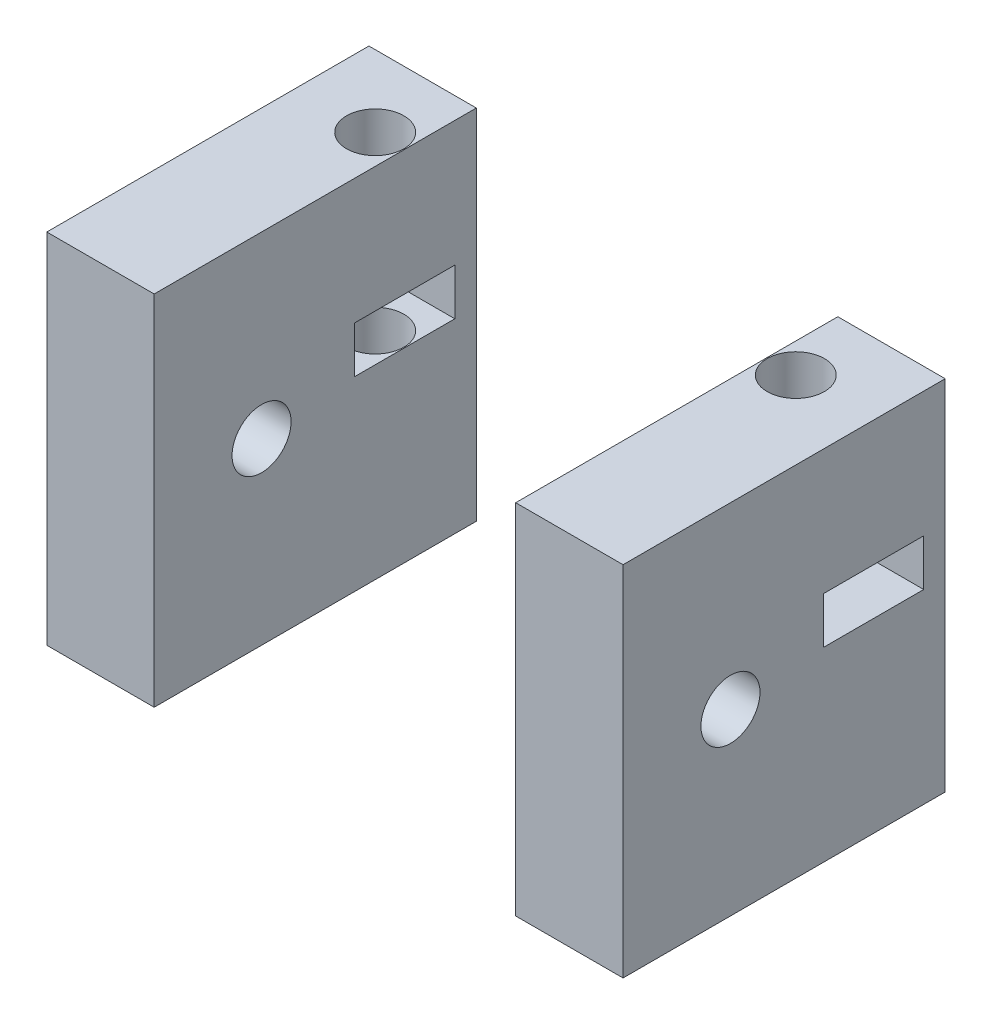
ISO-10303-21;
HEADER;
FILE_DESCRIPTION(('STEP AP214'),'2;1');
FILE_NAME('part.step','',(''),(''),'','','');
FILE_SCHEMA(('AUTOMOTIVE_DESIGN { 1 0 10303 214 1 1 1 1 }'));
ENDSEC;
DATA;
#1=APPLICATION_CONTEXT('core data for automotive mechanical design processes');
#2=APPLICATION_PROTOCOL_DEFINITION('international standard','automotive_design',2000,#1);
#3=PRODUCT_CONTEXT('',#1,'mechanical');
#4=PRODUCT('Part','Part','',(#3));
#5=PRODUCT_RELATED_PRODUCT_CATEGORY('part','',(#4));
#6=PRODUCT_DEFINITION_FORMATION('','',#4);
#7=PRODUCT_DEFINITION_CONTEXT('part definition',#1,'design');
#8=PRODUCT_DEFINITION('design','',#6,#7);
#9=PRODUCT_DEFINITION_SHAPE('','',#8);
#10=(LENGTH_UNIT() NAMED_UNIT(*) SI_UNIT(.MILLI.,.METRE.));
#11=(NAMED_UNIT(*) PLANE_ANGLE_UNIT() SI_UNIT($,.RADIAN.));
#12=(NAMED_UNIT(*) SI_UNIT($,.STERADIAN.) SOLID_ANGLE_UNIT());
#13=UNCERTAINTY_MEASURE_WITH_UNIT(LENGTH_MEASURE(1.E-05),#10,'distance_accuracy_value','');
#14=(GEOMETRIC_REPRESENTATION_CONTEXT(3) GLOBAL_UNCERTAINTY_ASSIGNED_CONTEXT((#13)) GLOBAL_UNIT_ASSIGNED_CONTEXT((#10,
#11,#12)) REPRESENTATION_CONTEXT('',''));
#15=CARTESIAN_POINT('',(0.,0.,0.));
#16=DIRECTION('',(0.,0.,1.));
#17=DIRECTION('',(1.,0.,0.));
#18=AXIS2_PLACEMENT_3D('',#15,#16,#17);
#19=CARTESIAN_POINT('',(11.75,-20.,0.));
#20=DIRECTION('',(0.,1.,0.));
#21=DIRECTION('',(0.,0.,1.));
#22=AXIS2_PLACEMENT_3D('',#19,#20,#21);
#23=CYLINDRICAL_SURFACE('',#22,1.6);
#24=CARTESIAN_POINT('',(11.75,-7.,0.));
#25=DIRECTION('',(0.,1.,0.));
#26=DIRECTION('',(0.,0.,1.));
#27=AXIS2_PLACEMENT_3D('',#24,#25,#26);
#28=CIRCLE('',#27,1.6);
#29=CARTESIAN_POINT('',(11.75,-7.,1.6));
#30=VERTEX_POINT('',#29);
#31=EDGE_CURVE('E156',#30,#30,#28,.F.);
#32=ORIENTED_EDGE('',*,*,#31,.T.);
#33=EDGE_LOOP('',(#32));
#34=FACE_BOUND('',#33,.T.);
#35=CARTESIAN_POINT('',(11.75,0.,0.));
#36=DIRECTION('',(0.,1.,0.));
#37=DIRECTION('',(0.,0.,1.));
#38=AXIS2_PLACEMENT_3D('',#35,#36,#37);
#39=CIRCLE('',#38,1.6);
#40=CARTESIAN_POINT('',(11.75,0.,1.6));
#41=VERTEX_POINT('',#40);
#42=EDGE_CURVE('E166',#41,#41,#39,.T.);
#43=ORIENTED_EDGE('',*,*,#42,.T.);
#44=EDGE_LOOP('',(#43));
#45=FACE_BOUND('',#44,.T.);
#46=ADVANCED_FACE('F49',(#34,#45),#23,.F.);
#47=CARTESIAN_POINT('',(16.1,-20.,-4.));
#48=DIRECTION('',(1.,0.,0.));
#49=DIRECTION('',(0.,0.,-1.));
#50=AXIS2_PLACEMENT_3D('',#47,#48,#49);
#51=PLANE('',#50);
#52=DIRECTION('',(0.,-1.,0.));
#53=VECTOR('',#52,1.);
#54=CARTESIAN_POINT('',(16.1,-7.,2.8));
#55=LINE('',#54,#53);
#56=CARTESIAN_POINT('',(16.1,-7.,2.8));
#57=VERTEX_POINT('',#56);
#58=CARTESIAN_POINT('',(16.1,-9.6,2.8));
#59=VERTEX_POINT('',#58);
#60=EDGE_CURVE('E65',#57,#59,#55,.T.);
#61=ORIENTED_EDGE('',*,*,#60,.F.);
#62=DIRECTION('',(0.,0.,1.));
#63=VECTOR('',#62,1.);
#64=CARTESIAN_POINT('',(16.1,-7.,2.8));
#65=LINE('',#64,#63);
#66=CARTESIAN_POINT('',(16.1,-7.,-2.8));
#67=VERTEX_POINT('',#66);
#68=EDGE_CURVE('E134',#67,#57,#65,.T.);
#69=ORIENTED_EDGE('',*,*,#68,.F.);
#70=DIRECTION('',(0.,1.,0.));
#71=VECTOR('',#70,1.);
#72=CARTESIAN_POINT('',(16.1,-7.,-2.8));
#73=LINE('',#72,#71);
#74=CARTESIAN_POINT('',(16.1,-9.6,-2.8));
#75=VERTEX_POINT('',#74);
#76=EDGE_CURVE('E117',#75,#67,#73,.T.);
#77=ORIENTED_EDGE('',*,*,#76,.F.);
#78=DIRECTION('',(0.,0.,-1.));
#79=VECTOR('',#78,1.);
#80=CARTESIAN_POINT('',(16.1,-9.6,2.8));
#81=LINE('',#80,#79);
#82=EDGE_CURVE('E126',#59,#75,#81,.T.);
#83=ORIENTED_EDGE('',*,*,#82,.F.);
#84=EDGE_LOOP('',(#61,#69,#77,#83));
#85=FACE_BOUND('',#84,.T.);
#86=CARTESIAN_POINT('',(16.1,-10.,8.));
#87=DIRECTION('',(1.,0.,0.));
#88=DIRECTION('',(0.,0.,-1.));
#89=AXIS2_PLACEMENT_3D('',#86,#87,#88);
#90=CIRCLE('',#89,1.65);
#91=CARTESIAN_POINT('',(16.1,-10.,6.35));
#92=VERTEX_POINT('',#91);
#93=EDGE_CURVE('E149',#92,#92,#90,.T.);
#94=ORIENTED_EDGE('',*,*,#93,.F.);
#95=EDGE_LOOP('',(#94));
#96=FACE_BOUND('',#95,.T.);
#97=DIRECTION('',(0.,0.,-1.));
#98=VECTOR('',#97,1.);
#99=CARTESIAN_POINT('',(16.1,0.,-4.));
#100=LINE('',#99,#98);
#101=CARTESIAN_POINT('',(16.1,0.,14.));
#102=VERTEX_POINT('',#101);
#103=CARTESIAN_POINT('',(16.1,0.,-4.));
#104=VERTEX_POINT('',#103);
#105=EDGE_CURVE('E165',#102,#104,#100,.T.);
#106=ORIENTED_EDGE('',*,*,#105,.F.);
#107=DIRECTION('',(0.,1.,0.));
#108=VECTOR('',#107,1.);
#109=CARTESIAN_POINT('',(16.1,-20.,14.));
#110=LINE('',#109,#108);
#111=CARTESIAN_POINT('',(16.1,-20.,14.));
#112=VERTEX_POINT('',#111);
#113=EDGE_CURVE('E202',#112,#102,#110,.T.);
#114=ORIENTED_EDGE('',*,*,#113,.F.);
#115=DIRECTION('',(0.,0.,-1.));
#116=VECTOR('',#115,1.);
#117=CARTESIAN_POINT('',(16.1,-20.,-4.));
#118=LINE('',#117,#116);
#119=CARTESIAN_POINT('',(16.1,-20.,-4.));
#120=VERTEX_POINT('',#119);
#121=EDGE_CURVE('E170',#112,#120,#118,.T.);
#122=ORIENTED_EDGE('',*,*,#121,.T.);
#123=DIRECTION('',(0.,1.,0.));
#124=VECTOR('',#123,1.);
#125=CARTESIAN_POINT('',(16.1,-20.,-4.));
#126=LINE('',#125,#124);
#127=EDGE_CURVE('E187',#120,#104,#126,.T.);
#128=ORIENTED_EDGE('',*,*,#127,.T.);
#129=EDGE_LOOP('',(#106,#114,#122,#128));
#130=FACE_BOUND('',#129,.T.);
#131=ADVANCED_FACE('F51',(#85,#96,#130),#51,.T.);
#132=CARTESIAN_POINT('',(16.1,-20.,14.));
#133=DIRECTION('',(0.,0.,1.));
#134=DIRECTION('',(1.,0.,0.));
#135=AXIS2_PLACEMENT_3D('',#132,#133,#134);
#136=PLANE('',#135);
#137=DIRECTION('',(1.,0.,0.));
#138=VECTOR('',#137,1.);
#139=CARTESIAN_POINT('',(16.1,0.,14.));
#140=LINE('',#139,#138);
#141=CARTESIAN_POINT('',(10.1,0.,14.));
#142=VERTEX_POINT('',#141);
#143=EDGE_CURVE('E175',#142,#102,#140,.T.);
#144=ORIENTED_EDGE('',*,*,#143,.F.);
#145=DIRECTION('',(0.,1.,0.));
#146=VECTOR('',#145,1.);
#147=CARTESIAN_POINT('',(10.1,-20.,14.));
#148=LINE('',#147,#146);
#149=CARTESIAN_POINT('',(10.1,-20.,14.));
#150=VERTEX_POINT('',#149);
#151=EDGE_CURVE('E205',#150,#142,#148,.T.);
#152=ORIENTED_EDGE('',*,*,#151,.F.);
#153=DIRECTION('',(1.,0.,0.));
#154=VECTOR('',#153,1.);
#155=CARTESIAN_POINT('',(16.1,-20.,14.));
#156=LINE('',#155,#154);
#157=EDGE_CURVE('E183',#150,#112,#156,.T.);
#158=ORIENTED_EDGE('',*,*,#157,.T.);
#159=ORIENTED_EDGE('',*,*,#113,.T.);
#160=EDGE_LOOP('',(#144,#152,#158,#159));
#161=FACE_BOUND('',#160,.T.);
#162=ADVANCED_FACE('F231',(#161),#136,.T.);
#163=CARTESIAN_POINT('',(10.1,-20.,14.));
#164=DIRECTION('',(-1.,0.,0.));
#165=DIRECTION('',(0.,0.,1.));
#166=AXIS2_PLACEMENT_3D('',#163,#164,#165);
#167=PLANE('',#166);
#168=DIRECTION('',(0.,1.,0.));
#169=VECTOR('',#168,1.);
#170=CARTESIAN_POINT('',(10.1,-20.,2.8));
#171=LINE('',#170,#169);
#172=CARTESIAN_POINT('',(10.1,-9.6,2.8));
#173=VERTEX_POINT('',#172);
#174=CARTESIAN_POINT('',(10.1,-7.,2.8));
#175=VERTEX_POINT('',#174);
#176=EDGE_CURVE('E12',#173,#175,#171,.T.);
#177=ORIENTED_EDGE('',*,*,#176,.F.);
#178=DIRECTION('',(0.,0.,1.));
#179=VECTOR('',#178,1.);
#180=CARTESIAN_POINT('',(10.1,-9.6,14.));
#181=LINE('',#180,#179);
#182=CARTESIAN_POINT('',(10.1,-9.6,-2.8));
#183=VERTEX_POINT('',#182);
#184=EDGE_CURVE('E153',#183,#173,#181,.T.);
#185=ORIENTED_EDGE('',*,*,#184,.F.);
#186=DIRECTION('',(0.,-1.,0.));
#187=VECTOR('',#186,1.);
#188=CARTESIAN_POINT('',(10.1,-20.,-2.8));
#189=LINE('',#188,#187);
#190=CARTESIAN_POINT('',(10.1,-7.,-2.8));
#191=VERTEX_POINT('',#190);
#192=EDGE_CURVE('E58',#191,#183,#189,.T.);
#193=ORIENTED_EDGE('',*,*,#192,.F.);
#194=DIRECTION('',(0.,0.,-1.));
#195=VECTOR('',#194,1.);
#196=CARTESIAN_POINT('',(10.1,-7.,14.));
#197=LINE('',#196,#195);
#198=EDGE_CURVE('E157',#175,#191,#197,.T.);
#199=ORIENTED_EDGE('',*,*,#198,.F.);
#200=EDGE_LOOP('',(#177,#185,#193,#199));
#201=FACE_BOUND('',#200,.T.);
#202=CARTESIAN_POINT('',(10.1,-10.,8.));
#203=DIRECTION('',(-1.,0.,0.));
#204=DIRECTION('',(0.,0.,1.));
#205=AXIS2_PLACEMENT_3D('',#202,#203,#204);
#206=CIRCLE('',#205,1.65);
#207=CARTESIAN_POINT('',(10.1,-10.,9.65));
#208=VERTEX_POINT('',#207);
#209=EDGE_CURVE('E160',#208,#208,#206,.T.);
#210=ORIENTED_EDGE('',*,*,#209,.F.);
#211=EDGE_LOOP('',(#210));
#212=FACE_BOUND('',#211,.T.);
#213=DIRECTION('',(0.,0.,1.));
#214=VECTOR('',#213,1.);
#215=CARTESIAN_POINT('',(10.1,0.,14.));
#216=LINE('',#215,#214);
#217=CARTESIAN_POINT('',(10.1,0.,-4.));
#218=VERTEX_POINT('',#217);
#219=EDGE_CURVE('E195',#218,#142,#216,.T.);
#220=ORIENTED_EDGE('',*,*,#219,.F.);
#221=DIRECTION('',(0.,1.,0.));
#222=VECTOR('',#221,1.);
#223=CARTESIAN_POINT('',(10.1,-20.,-4.));
#224=LINE('',#223,#222);
#225=CARTESIAN_POINT('',(10.1,-20.,-4.));
#226=VERTEX_POINT('',#225);
#227=EDGE_CURVE('E208',#226,#218,#224,.T.);
#228=ORIENTED_EDGE('',*,*,#227,.F.);
#229=DIRECTION('',(0.,0.,1.));
#230=VECTOR('',#229,1.);
#231=CARTESIAN_POINT('',(10.1,-20.,14.));
#232=LINE('',#231,#230);
#233=EDGE_CURVE('E179',#226,#150,#232,.T.);
#234=ORIENTED_EDGE('',*,*,#233,.T.);
#235=ORIENTED_EDGE('',*,*,#151,.T.);
#236=EDGE_LOOP('',(#220,#228,#234,#235));
#237=FACE_BOUND('',#236,.T.);
#238=ADVANCED_FACE('F227',(#201,#212,#237),#167,.T.);
#239=CARTESIAN_POINT('',(10.1,-20.,-4.));
#240=DIRECTION('',(0.,0.,-1.));
#241=DIRECTION('',(-1.,0.,0.));
#242=AXIS2_PLACEMENT_3D('',#239,#240,#241);
#243=PLANE('',#242);
#244=DIRECTION('',(-1.,0.,0.));
#245=VECTOR('',#244,1.);
#246=CARTESIAN_POINT('',(10.1,0.,-4.));
#247=LINE('',#246,#245);
#248=EDGE_CURVE('E191',#104,#218,#247,.T.);
#249=ORIENTED_EDGE('',*,*,#248,.F.);
#250=ORIENTED_EDGE('',*,*,#127,.F.);
#251=DIRECTION('',(-1.,0.,0.));
#252=VECTOR('',#251,1.);
#253=CARTESIAN_POINT('',(10.1,-20.,-4.));
#254=LINE('',#253,#252);
#255=EDGE_CURVE('E174',#120,#226,#254,.T.);
#256=ORIENTED_EDGE('',*,*,#255,.T.);
#257=ORIENTED_EDGE('',*,*,#227,.T.);
#258=EDGE_LOOP('',(#249,#250,#256,#257));
#259=FACE_BOUND('',#258,.T.);
#260=ADVANCED_FACE('F230',(#259),#243,.T.);
#261=CARTESIAN_POINT('',(0.,-20.,0.));
#262=DIRECTION('',(0.,-1.,0.));
#263=DIRECTION('',(0.,0.,-1.));
#264=AXIS2_PLACEMENT_3D('',#261,#262,#263);
#265=PLANE('',#264);
#266=CARTESIAN_POINT('',(11.75,-20.,0.));
#267=DIRECTION('',(0.,1.,0.));
#268=DIRECTION('',(0.,0.,1.));
#269=AXIS2_PLACEMENT_3D('',#266,#267,#268);
#270=CIRCLE('',#269,1.6);
#271=CARTESIAN_POINT('',(11.75,-20.,1.6));
#272=VERTEX_POINT('',#271);
#273=EDGE_CURVE('E161',#272,#272,#270,.T.);
#274=ORIENTED_EDGE('',*,*,#273,.T.);
#275=EDGE_LOOP('',(#274));
#276=FACE_BOUND('',#275,.T.);
#277=ORIENTED_EDGE('',*,*,#121,.F.);
#278=ORIENTED_EDGE('',*,*,#157,.F.);
#279=ORIENTED_EDGE('',*,*,#233,.F.);
#280=ORIENTED_EDGE('',*,*,#255,.F.);
#281=EDGE_LOOP('',(#277,#278,#279,#280));
#282=FACE_BOUND('',#281,.T.);
#283=ADVANCED_FACE('F245',(#276,#282),#265,.T.);
#284=CARTESIAN_POINT('',(0.,0.,0.));
#285=DIRECTION('',(0.,-1.,0.));
#286=DIRECTION('',(0.,0.,-1.));
#287=AXIS2_PLACEMENT_3D('',#284,#285,#286);
#288=PLANE('',#287);
#289=ORIENTED_EDGE('',*,*,#42,.F.);
#290=EDGE_LOOP('',(#289));
#291=FACE_BOUND('',#290,.T.);
#292=ORIENTED_EDGE('',*,*,#105,.T.);
#293=ORIENTED_EDGE('',*,*,#248,.T.);
#294=ORIENTED_EDGE('',*,*,#219,.T.);
#295=ORIENTED_EDGE('',*,*,#143,.T.);
#296=EDGE_LOOP('',(#292,#293,#294,#295));
#297=FACE_BOUND('',#296,.T.);
#298=ADVANCED_FACE('F239',(#291,#297),#288,.F.);
#299=CARTESIAN_POINT('',(11.75,-9.6,0.));
#300=DIRECTION('',(0.,-1.,0.));
#301=DIRECTION('',(0.,0.,-1.));
#302=AXIS2_PLACEMENT_3D('',#299,#300,#301);
#303=CIRCLE('',#302,1.6);
#304=CARTESIAN_POINT('',(11.75,-9.6,-1.60000000000001));
#305=VERTEX_POINT('',#304);
#306=EDGE_CURVE('E144',#305,#305,#303,.F.);
#307=ORIENTED_EDGE('',*,*,#306,.T.);
#308=EDGE_LOOP('',(#307));
#309=FACE_BOUND('',#308,.T.);
#310=ORIENTED_EDGE('',*,*,#273,.F.);
#311=EDGE_LOOP('',(#310));
#312=FACE_BOUND('',#311,.T.);
#313=ADVANCED_FACE('F258',(#309,#312),#23,.F.);
#314=CARTESIAN_POINT('',(-16.1,-7.,2.8));
#315=DIRECTION('',(0.,1.,0.));
#316=DIRECTION('',(0.,0.,1.));
#317=AXIS2_PLACEMENT_3D('',#314,#315,#316);
#318=PLANE('',#317);
#319=ORIENTED_EDGE('',*,*,#198,.T.);
#320=DIRECTION('',(1.,0.,0.));
#321=VECTOR('',#320,1.);
#322=CARTESIAN_POINT('',(-16.1,-7.,-2.8));
#323=LINE('',#322,#321);
#324=EDGE_CURVE('E122',#191,#67,#323,.T.);
#325=ORIENTED_EDGE('',*,*,#324,.T.);
#326=ORIENTED_EDGE('',*,*,#68,.T.);
#327=DIRECTION('',(1.,0.,0.));
#328=VECTOR('',#327,1.);
#329=CARTESIAN_POINT('',(-16.1,-7.,2.8));
#330=LINE('',#329,#328);
#331=EDGE_CURVE('E141',#175,#57,#330,.T.);
#332=ORIENTED_EDGE('',*,*,#331,.F.);
#333=EDGE_LOOP('',(#319,#325,#326,#332));
#334=FACE_BOUND('',#333,.T.);
#335=ORIENTED_EDGE('',*,*,#31,.F.);
#336=EDGE_LOOP('',(#335));
#337=FACE_BOUND('',#336,.T.);
#338=ADVANCED_FACE('F265',(#334,#337),#318,.F.);
#339=CARTESIAN_POINT('',(-16.1,-9.6,2.8));
#340=DIRECTION('',(0.,-1.,0.));
#341=DIRECTION('',(0.,0.,-1.));
#342=AXIS2_PLACEMENT_3D('',#339,#340,#341);
#343=PLANE('',#342);
#344=ORIENTED_EDGE('',*,*,#184,.T.);
#345=DIRECTION('',(1.,0.,0.));
#346=VECTOR('',#345,1.);
#347=CARTESIAN_POINT('',(-16.1,-9.6,2.8));
#348=LINE('',#347,#346);
#349=EDGE_CURVE('E123',#173,#59,#348,.T.);
#350=ORIENTED_EDGE('',*,*,#349,.T.);
#351=ORIENTED_EDGE('',*,*,#82,.T.);
#352=DIRECTION('',(1.,0.,0.));
#353=VECTOR('',#352,1.);
#354=CARTESIAN_POINT('',(-16.1,-9.6,-2.8));
#355=LINE('',#354,#353);
#356=EDGE_CURVE('E73',#183,#75,#355,.T.);
#357=ORIENTED_EDGE('',*,*,#356,.F.);
#358=EDGE_LOOP('',(#344,#350,#351,#357));
#359=FACE_BOUND('',#358,.T.);
#360=ORIENTED_EDGE('',*,*,#306,.F.);
#361=EDGE_LOOP('',(#360));
#362=FACE_BOUND('',#361,.T.);
#363=ADVANCED_FACE('F127',(#359,#362),#343,.F.);
#364=CARTESIAN_POINT('',(-16.1,-7.,2.8));
#365=DIRECTION('',(0.,0.,1.));
#366=DIRECTION('',(1.,0.,0.));
#367=AXIS2_PLACEMENT_3D('',#364,#365,#366);
#368=PLANE('',#367);
#369=ORIENTED_EDGE('',*,*,#176,.T.);
#370=ORIENTED_EDGE('',*,*,#331,.T.);
#371=ORIENTED_EDGE('',*,*,#60,.T.);
#372=ORIENTED_EDGE('',*,*,#349,.F.);
#373=EDGE_LOOP('',(#369,#370,#371,#372));
#374=FACE_BOUND('',#373,.T.);
#375=ADVANCED_FACE('F313',(#374),#368,.F.);
#376=CARTESIAN_POINT('',(-16.1,-7.,-2.8));
#377=DIRECTION('',(0.,0.,-1.));
#378=DIRECTION('',(0.,1.,0.));
#379=AXIS2_PLACEMENT_3D('',#376,#377,#378);
#380=PLANE('',#379);
#381=ORIENTED_EDGE('',*,*,#192,.T.);
#382=ORIENTED_EDGE('',*,*,#356,.T.);
#383=ORIENTED_EDGE('',*,*,#76,.T.);
#384=ORIENTED_EDGE('',*,*,#324,.F.);
#385=EDGE_LOOP('',(#381,#382,#383,#384));
#386=FACE_BOUND('',#385,.T.);
#387=ADVANCED_FACE('F114',(#386),#380,.F.);
#388=CARTESIAN_POINT('',(-16.1,-10.,8.));
#389=DIRECTION('',(1.,0.,0.));
#390=DIRECTION('',(0.,0.,-1.));
#391=AXIS2_PLACEMENT_3D('',#388,#389,#390);
#392=CYLINDRICAL_SURFACE('',#391,1.65);
#393=ORIENTED_EDGE('',*,*,#209,.T.);
#394=EDGE_LOOP('',(#393));
#395=FACE_BOUND('',#394,.T.);
#396=ORIENTED_EDGE('',*,*,#93,.T.);
#397=EDGE_LOOP('',(#396));
#398=FACE_BOUND('',#397,.T.);
#399=ADVANCED_FACE('F224',(#395,#398),#392,.F.);
#400=CLOSED_SHELL('',(#46,#131,#162,#238,#260,#283,#298,#313,#338,#363,#375,#387,#399));
#401=MANIFOLD_SOLID_BREP('B2',#400);
#402=CARTESIAN_POINT('',(-11.75,-20.,0.));
#403=DIRECTION('',(0.,1.,0.));
#404=DIRECTION('',(0.,0.,1.));
#405=AXIS2_PLACEMENT_3D('',#402,#403,#404);
#406=CYLINDRICAL_SURFACE('',#405,1.6);
#407=CARTESIAN_POINT('',(-11.75,-7.,0.));
#408=DIRECTION('',(0.,1.,0.));
#409=DIRECTION('',(0.,0.,1.));
#410=AXIS2_PLACEMENT_3D('',#407,#408,#409);
#411=CIRCLE('',#410,1.6);
#412=CARTESIAN_POINT('',(-11.75,-7.,1.6));
#413=VERTEX_POINT('',#412);
#414=EDGE_CURVE('E375',#413,#413,#411,.F.);
#415=ORIENTED_EDGE('',*,*,#414,.T.);
#416=EDGE_LOOP('',(#415));
#417=FACE_BOUND('',#416,.T.);
#418=CARTESIAN_POINT('',(-11.75,0.,0.));
#419=DIRECTION('',(0.,1.,0.));
#420=DIRECTION('',(0.,0.,1.));
#421=AXIS2_PLACEMENT_3D('',#418,#419,#420);
#422=CIRCLE('',#421,1.6);
#423=CARTESIAN_POINT('',(-11.75,0.,1.6));
#424=VERTEX_POINT('',#423);
#425=EDGE_CURVE('E481',#424,#424,#422,.T.);
#426=ORIENTED_EDGE('',*,*,#425,.T.);
#427=EDGE_LOOP('',(#426));
#428=FACE_BOUND('',#427,.T.);
#429=ADVANCED_FACE('F371',(#417,#428),#406,.F.);
#430=CARTESIAN_POINT('',(-10.1,-20.,14.));
#431=DIRECTION('',(1.,0.,0.));
#432=DIRECTION('',(0.,0.,-1.));
#433=AXIS2_PLACEMENT_3D('',#430,#431,#432);
#434=PLANE('',#433);
#435=DIRECTION('',(0.,-1.,0.));
#436=VECTOR('',#435,1.);
#437=CARTESIAN_POINT('',(-10.1,-20.,2.8));
#438=LINE('',#437,#436);
#439=CARTESIAN_POINT('',(-10.1,-7.,2.8));
#440=VERTEX_POINT('',#439);
#441=CARTESIAN_POINT('',(-10.1,-9.6,2.8));
#442=VERTEX_POINT('',#441);
#443=EDGE_CURVE('E443',#440,#442,#438,.T.);
#444=ORIENTED_EDGE('',*,*,#443,.F.);
#445=DIRECTION('',(0.,0.,1.));
#446=VECTOR('',#445,1.);
#447=CARTESIAN_POINT('',(-10.1,-7.,14.));
#448=LINE('',#447,#446);
#449=CARTESIAN_POINT('',(-10.1,-7.,-2.8));
#450=VERTEX_POINT('',#449);
#451=EDGE_CURVE('E473',#450,#440,#448,.T.);
#452=ORIENTED_EDGE('',*,*,#451,.F.);
#453=DIRECTION('',(0.,1.,0.));
#454=VECTOR('',#453,1.);
#455=CARTESIAN_POINT('',(-10.1,-20.,-2.8));
#456=LINE('',#455,#454);
#457=CARTESIAN_POINT('',(-10.1,-9.6,-2.8));
#458=VERTEX_POINT('',#457);
#459=EDGE_CURVE('E478',#458,#450,#456,.T.);
#460=ORIENTED_EDGE('',*,*,#459,.F.);
#461=DIRECTION('',(0.,0.,-1.));
#462=VECTOR('',#461,1.);
#463=CARTESIAN_POINT('',(-10.1,-9.6,14.));
#464=LINE('',#463,#462);
#465=EDGE_CURVE('E471',#442,#458,#464,.T.);
#466=ORIENTED_EDGE('',*,*,#465,.F.);
#467=EDGE_LOOP('',(#444,#452,#460,#466));
#468=FACE_BOUND('',#467,.T.);
#469=CARTESIAN_POINT('',(-10.1,-10.,8.));
#470=DIRECTION('',(1.,0.,0.));
#471=DIRECTION('',(0.,0.,-1.));
#472=AXIS2_PLACEMENT_3D('',#469,#470,#471);
#473=CIRCLE('',#472,1.65);
#474=CARTESIAN_POINT('',(-10.1,-10.,6.35));
#475=VERTEX_POINT('',#474);
#476=EDGE_CURVE('E475',#475,#475,#473,.T.);
#477=ORIENTED_EDGE('',*,*,#476,.F.);
#478=EDGE_LOOP('',(#477));
#479=FACE_BOUND('',#478,.T.);
#480=DIRECTION('',(0.,0.,-1.));
#481=VECTOR('',#480,1.);
#482=CARTESIAN_POINT('',(-10.1,0.,14.));
#483=LINE('',#482,#481);
#484=CARTESIAN_POINT('',(-10.1,0.,14.));
#485=VERTEX_POINT('',#484);
#486=CARTESIAN_POINT('',(-10.1,0.,-4.));
#487=VERTEX_POINT('',#486);
#488=EDGE_CURVE('E485',#485,#487,#483,.T.);
#489=ORIENTED_EDGE('',*,*,#488,.F.);
#490=DIRECTION('',(0.,1.,0.));
#491=VECTOR('',#490,1.);
#492=CARTESIAN_POINT('',(-10.1,-20.,14.));
#493=LINE('',#492,#491);
#494=CARTESIAN_POINT('',(-10.1,-20.,14.));
#495=VERTEX_POINT('',#494);
#496=EDGE_CURVE('E47',#495,#485,#493,.T.);
#497=ORIENTED_EDGE('',*,*,#496,.F.);
#498=DIRECTION('',(0.,0.,-1.));
#499=VECTOR('',#498,1.);
#500=CARTESIAN_POINT('',(-10.1,-20.,14.));
#501=LINE('',#500,#499);
#502=CARTESIAN_POINT('',(-10.1,-20.,-4.));
#503=VERTEX_POINT('',#502);
#504=EDGE_CURVE('E488',#495,#503,#501,.T.);
#505=ORIENTED_EDGE('',*,*,#504,.T.);
#506=DIRECTION('',(0.,1.,0.));
#507=VECTOR('',#506,1.);
#508=CARTESIAN_POINT('',(-10.1,-20.,-4.));
#509=LINE('',#508,#507);
#510=EDGE_CURVE('E501',#503,#487,#509,.T.);
#511=ORIENTED_EDGE('',*,*,#510,.T.);
#512=EDGE_LOOP('',(#489,#497,#505,#511));
#513=FACE_BOUND('',#512,.T.);
#514=ADVANCED_FACE('F373',(#468,#479,#513),#434,.T.);
#515=CARTESIAN_POINT('',(-16.1,-20.,14.));
#516=DIRECTION('',(0.,0.,1.));
#517=DIRECTION('',(1.,0.,0.));
#518=AXIS2_PLACEMENT_3D('',#515,#516,#517);
#519=PLANE('',#518);
#520=DIRECTION('',(1.,0.,0.));
#521=VECTOR('',#520,1.);
#522=CARTESIAN_POINT('',(-16.1,0.,14.));
#523=LINE('',#522,#521);
#524=CARTESIAN_POINT('',(-16.1,0.,14.));
#525=VERTEX_POINT('',#524);
#526=EDGE_CURVE('E492',#525,#485,#523,.T.);
#527=ORIENTED_EDGE('',*,*,#526,.F.);
#528=DIRECTION('',(0.,1.,0.));
#529=VECTOR('',#528,1.);
#530=CARTESIAN_POINT('',(-16.1,-20.,14.));
#531=LINE('',#530,#529);
#532=CARTESIAN_POINT('',(-16.1,-20.,14.));
#533=VERTEX_POINT('',#532);
#534=EDGE_CURVE('E380',#533,#525,#531,.T.);
#535=ORIENTED_EDGE('',*,*,#534,.F.);
#536=DIRECTION('',(1.,0.,0.));
#537=VECTOR('',#536,1.);
#538=CARTESIAN_POINT('',(-16.1,-20.,14.));
#539=LINE('',#538,#537);
#540=EDGE_CURVE('E498',#533,#495,#539,.T.);
#541=ORIENTED_EDGE('',*,*,#540,.T.);
#542=ORIENTED_EDGE('',*,*,#496,.T.);
#543=EDGE_LOOP('',(#527,#535,#541,#542));
#544=FACE_BOUND('',#543,.T.);
#545=ADVANCED_FACE('F538',(#544),#519,.T.);
#546=CARTESIAN_POINT('',(-16.1,-20.,-4.));
#547=DIRECTION('',(-1.,0.,0.));
#548=DIRECTION('',(0.,0.,1.));
#549=AXIS2_PLACEMENT_3D('',#546,#547,#548);
#550=PLANE('',#549);
#551=DIRECTION('',(0.,-1.,0.));
#552=VECTOR('',#551,1.);
#553=CARTESIAN_POINT('',(-16.1,-7.,2.8));
#554=LINE('',#553,#552);
#555=CARTESIAN_POINT('',(-16.1,-7.,2.8));
#556=VERTEX_POINT('',#555);
#557=CARTESIAN_POINT('',(-16.1,-9.6,2.8));
#558=VERTEX_POINT('',#557);
#559=EDGE_CURVE('E440',#556,#558,#554,.T.);
#560=ORIENTED_EDGE('',*,*,#559,.T.);
#561=DIRECTION('',(0.,0.,-1.));
#562=VECTOR('',#561,1.);
#563=CARTESIAN_POINT('',(-16.1,-9.6,2.8));
#564=LINE('',#563,#562);
#565=CARTESIAN_POINT('',(-16.1,-9.6,-2.8));
#566=VERTEX_POINT('',#565);
#567=EDGE_CURVE('E449',#558,#566,#564,.T.);
#568=ORIENTED_EDGE('',*,*,#567,.T.);
#569=DIRECTION('',(0.,1.,0.));
#570=VECTOR('',#569,1.);
#571=CARTESIAN_POINT('',(-16.1,-7.,-2.8));
#572=LINE('',#571,#570);
#573=CARTESIAN_POINT('',(-16.1,-7.,-2.8));
#574=VERTEX_POINT('',#573);
#575=EDGE_CURVE('E396',#566,#574,#572,.T.);
#576=ORIENTED_EDGE('',*,*,#575,.T.);
#577=DIRECTION('',(0.,0.,1.));
#578=VECTOR('',#577,1.);
#579=CARTESIAN_POINT('',(-16.1,-7.,2.8));
#580=LINE('',#579,#578);
#581=EDGE_CURVE('E446',#574,#556,#580,.T.);
#582=ORIENTED_EDGE('',*,*,#581,.T.);
#583=EDGE_LOOP('',(#560,#568,#576,#582));
#584=FACE_BOUND('',#583,.T.);
#585=CARTESIAN_POINT('',(-16.1,-10.,8.));
#586=DIRECTION('',(1.,0.,0.));
#587=DIRECTION('',(0.,0.,-1.));
#588=AXIS2_PLACEMENT_3D('',#585,#586,#587);
#589=CIRCLE('',#588,1.65);
#590=CARTESIAN_POINT('',(-16.1,-10.,6.35));
#591=VERTEX_POINT('',#590);
#592=EDGE_CURVE('E457',#591,#591,#589,.T.);
#593=ORIENTED_EDGE('',*,*,#592,.T.);
#594=EDGE_LOOP('',(#593));
#595=FACE_BOUND('',#594,.T.);
#596=DIRECTION('',(0.,0.,1.));
#597=VECTOR('',#596,1.);
#598=CARTESIAN_POINT('',(-16.1,0.,-4.));
#599=LINE('',#598,#597);
#600=CARTESIAN_POINT('',(-16.1,0.,-4.));
#601=VERTEX_POINT('',#600);
#602=EDGE_CURVE('E507',#601,#525,#599,.T.);
#603=ORIENTED_EDGE('',*,*,#602,.F.);
#604=DIRECTION('',(0.,1.,0.));
#605=VECTOR('',#604,1.);
#606=CARTESIAN_POINT('',(-16.1,-20.,-4.));
#607=LINE('',#606,#605);
#608=CARTESIAN_POINT('',(-16.1,-20.,-4.));
#609=VERTEX_POINT('',#608);
#610=EDGE_CURVE('E513',#609,#601,#607,.T.);
#611=ORIENTED_EDGE('',*,*,#610,.F.);
#612=DIRECTION('',(0.,0.,1.));
#613=VECTOR('',#612,1.);
#614=CARTESIAN_POINT('',(-16.1,-20.,-4.));
#615=LINE('',#614,#613);
#616=EDGE_CURVE('E495',#609,#533,#615,.T.);
#617=ORIENTED_EDGE('',*,*,#616,.T.);
#618=ORIENTED_EDGE('',*,*,#534,.T.);
#619=EDGE_LOOP('',(#603,#611,#617,#618));
#620=FACE_BOUND('',#619,.T.);
#621=ADVANCED_FACE('F454',(#584,#595,#620),#550,.T.);
#622=CARTESIAN_POINT('',(-10.1,-20.,-4.));
#623=DIRECTION('',(0.,0.,-1.));
#624=DIRECTION('',(-1.,0.,0.));
#625=AXIS2_PLACEMENT_3D('',#622,#623,#624);
#626=PLANE('',#625);
#627=DIRECTION('',(-1.,0.,0.));
#628=VECTOR('',#627,1.);
#629=CARTESIAN_POINT('',(-10.1,0.,-4.));
#630=LINE('',#629,#628);
#631=EDGE_CURVE('E504',#487,#601,#630,.T.);
#632=ORIENTED_EDGE('',*,*,#631,.F.);
#633=ORIENTED_EDGE('',*,*,#510,.F.);
#634=DIRECTION('',(-1.,0.,0.));
#635=VECTOR('',#634,1.);
#636=CARTESIAN_POINT('',(-10.1,-20.,-4.));
#637=LINE('',#636,#635);
#638=EDGE_CURVE('E491',#503,#609,#637,.T.);
#639=ORIENTED_EDGE('',*,*,#638,.T.);
#640=ORIENTED_EDGE('',*,*,#610,.T.);
#641=EDGE_LOOP('',(#632,#633,#639,#640));
#642=FACE_BOUND('',#641,.T.);
#643=ADVANCED_FACE('F555',(#642),#626,.T.);
#644=CARTESIAN_POINT('',(0.,-20.,0.));
#645=DIRECTION('',(0.,1.,0.));
#646=DIRECTION('',(0.,0.,1.));
#647=AXIS2_PLACEMENT_3D('',#644,#645,#646);
#648=PLANE('',#647);
#649=CARTESIAN_POINT('',(-11.75,-20.,0.));
#650=DIRECTION('',(0.,1.,0.));
#651=DIRECTION('',(0.,0.,1.));
#652=AXIS2_PLACEMENT_3D('',#649,#650,#651);
#653=CIRCLE('',#652,1.6);
#654=CARTESIAN_POINT('',(-11.75,-20.,1.6));
#655=VERTEX_POINT('',#654);
#656=EDGE_CURVE('E482',#655,#655,#653,.T.);
#657=ORIENTED_EDGE('',*,*,#656,.T.);
#658=EDGE_LOOP('',(#657));
#659=FACE_BOUND('',#658,.T.);
#660=ORIENTED_EDGE('',*,*,#504,.F.);
#661=ORIENTED_EDGE('',*,*,#540,.F.);
#662=ORIENTED_EDGE('',*,*,#616,.F.);
#663=ORIENTED_EDGE('',*,*,#638,.F.);
#664=EDGE_LOOP('',(#660,#661,#662,#663));
#665=FACE_BOUND('',#664,.T.);
#666=ADVANCED_FACE('F549',(#659,#665),#648,.F.);
#667=CARTESIAN_POINT('',(0.,0.,0.));
#668=DIRECTION('',(0.,1.,0.));
#669=DIRECTION('',(0.,0.,1.));
#670=AXIS2_PLACEMENT_3D('',#667,#668,#669);
#671=PLANE('',#670);
#672=ORIENTED_EDGE('',*,*,#425,.F.);
#673=EDGE_LOOP('',(#672));
#674=FACE_BOUND('',#673,.T.);
#675=ORIENTED_EDGE('',*,*,#488,.T.);
#676=ORIENTED_EDGE('',*,*,#631,.T.);
#677=ORIENTED_EDGE('',*,*,#602,.T.);
#678=ORIENTED_EDGE('',*,*,#526,.T.);
#679=EDGE_LOOP('',(#675,#676,#677,#678));
#680=FACE_BOUND('',#679,.T.);
#681=ADVANCED_FACE('F545',(#674,#680),#671,.T.);
#682=CARTESIAN_POINT('',(-11.75,-9.6,0.));
#683=DIRECTION('',(0.,-1.,0.));
#684=DIRECTION('',(0.,0.,-1.));
#685=AXIS2_PLACEMENT_3D('',#682,#683,#684);
#686=CIRCLE('',#685,1.6);
#687=CARTESIAN_POINT('',(-11.75,-9.6,-1.6));
#688=VERTEX_POINT('',#687);
#689=EDGE_CURVE('E466',#688,#688,#686,.F.);
#690=ORIENTED_EDGE('',*,*,#689,.T.);
#691=EDGE_LOOP('',(#690));
#692=FACE_BOUND('',#691,.T.);
#693=ORIENTED_EDGE('',*,*,#656,.F.);
#694=EDGE_LOOP('',(#693));
#695=FACE_BOUND('',#694,.T.);
#696=ADVANCED_FACE('F518',(#692,#695),#406,.F.);
#697=CARTESIAN_POINT('',(-16.1,-7.,2.8));
#698=DIRECTION('',(0.,1.,0.));
#699=DIRECTION('',(0.,0.,1.));
#700=AXIS2_PLACEMENT_3D('',#697,#698,#699);
#701=PLANE('',#700);
#702=ORIENTED_EDGE('',*,*,#451,.T.);
#703=DIRECTION('',(1.,0.,0.));
#704=VECTOR('',#703,1.);
#705=CARTESIAN_POINT('',(-16.1,-7.,2.8));
#706=LINE('',#705,#704);
#707=EDGE_CURVE('E464',#556,#440,#706,.T.);
#708=ORIENTED_EDGE('',*,*,#707,.F.);
#709=ORIENTED_EDGE('',*,*,#581,.F.);
#710=DIRECTION('',(1.,0.,0.));
#711=VECTOR('',#710,1.);
#712=CARTESIAN_POINT('',(-16.1,-7.,-2.8));
#713=LINE('',#712,#711);
#714=EDGE_CURVE('E467',#574,#450,#713,.T.);
#715=ORIENTED_EDGE('',*,*,#714,.T.);
#716=EDGE_LOOP('',(#702,#708,#709,#715));
#717=FACE_BOUND('',#716,.T.);
#718=ORIENTED_EDGE('',*,*,#414,.F.);
#719=EDGE_LOOP('',(#718));
#720=FACE_BOUND('',#719,.T.);
#721=ADVANCED_FACE('F521',(#717,#720),#701,.F.);
#722=CARTESIAN_POINT('',(-16.1,-9.6,2.8));
#723=DIRECTION('',(0.,-1.,0.));
#724=DIRECTION('',(0.,0.,-1.));
#725=AXIS2_PLACEMENT_3D('',#722,#723,#724);
#726=PLANE('',#725);
#727=ORIENTED_EDGE('',*,*,#465,.T.);
#728=DIRECTION('',(1.,0.,0.));
#729=VECTOR('',#728,1.);
#730=CARTESIAN_POINT('',(-16.1,-9.6,-2.8));
#731=LINE('',#730,#729);
#732=EDGE_CURVE('E445',#566,#458,#731,.T.);
#733=ORIENTED_EDGE('',*,*,#732,.F.);
#734=ORIENTED_EDGE('',*,*,#567,.F.);
#735=DIRECTION('',(1.,0.,0.));
#736=VECTOR('',#735,1.);
#737=CARTESIAN_POINT('',(-16.1,-9.6,2.8));
#738=LINE('',#737,#736);
#739=EDGE_CURVE('E388',#558,#442,#738,.T.);
#740=ORIENTED_EDGE('',*,*,#739,.T.);
#741=EDGE_LOOP('',(#727,#733,#734,#740));
#742=FACE_BOUND('',#741,.T.);
#743=ORIENTED_EDGE('',*,*,#689,.F.);
#744=EDGE_LOOP('',(#743));
#745=FACE_BOUND('',#744,.T.);
#746=ADVANCED_FACE('F450',(#742,#745),#726,.F.);
#747=CARTESIAN_POINT('',(-16.1,-7.,2.8));
#748=DIRECTION('',(0.,0.,1.));
#749=DIRECTION('',(1.,0.,0.));
#750=AXIS2_PLACEMENT_3D('',#747,#748,#749);
#751=PLANE('',#750);
#752=ORIENTED_EDGE('',*,*,#443,.T.);
#753=ORIENTED_EDGE('',*,*,#739,.F.);
#754=ORIENTED_EDGE('',*,*,#559,.F.);
#755=ORIENTED_EDGE('',*,*,#707,.T.);
#756=EDGE_LOOP('',(#752,#753,#754,#755));
#757=FACE_BOUND('',#756,.T.);
#758=ADVANCED_FACE('F437',(#757),#751,.F.);
#759=CARTESIAN_POINT('',(-16.1,-7.,-2.8));
#760=DIRECTION('',(0.,0.,-1.));
#761=DIRECTION('',(0.,1.,0.));
#762=AXIS2_PLACEMENT_3D('',#759,#760,#761);
#763=PLANE('',#762);
#764=ORIENTED_EDGE('',*,*,#459,.T.);
#765=ORIENTED_EDGE('',*,*,#714,.F.);
#766=ORIENTED_EDGE('',*,*,#575,.F.);
#767=ORIENTED_EDGE('',*,*,#732,.T.);
#768=EDGE_LOOP('',(#764,#765,#766,#767));
#769=FACE_BOUND('',#768,.T.);
#770=ADVANCED_FACE('F527',(#769),#763,.F.);
#771=CARTESIAN_POINT('',(-16.1,-10.,8.));
#772=DIRECTION('',(1.,0.,0.));
#773=DIRECTION('',(0.,0.,-1.));
#774=AXIS2_PLACEMENT_3D('',#771,#772,#773);
#775=CYLINDRICAL_SURFACE('',#774,1.65);
#776=ORIENTED_EDGE('',*,*,#476,.T.);
#777=EDGE_LOOP('',(#776));
#778=FACE_BOUND('',#777,.T.);
#779=ORIENTED_EDGE('',*,*,#592,.F.);
#780=EDGE_LOOP('',(#779));
#781=FACE_BOUND('',#780,.T.);
#782=ADVANCED_FACE('F634',(#778,#781),#775,.F.);
#783=CLOSED_SHELL('',(#429,#514,#545,#621,#643,#666,#681,#696,#721,#746,#758,#770,#782));
#784=MANIFOLD_SOLID_BREP('B6',#783);
#785=ADVANCED_BREP_SHAPE_REPRESENTATION('',(#18,#401,#784),#14);
#786=SHAPE_DEFINITION_REPRESENTATION(#9,#785);
ENDSEC;
END-ISO-10303-21;
